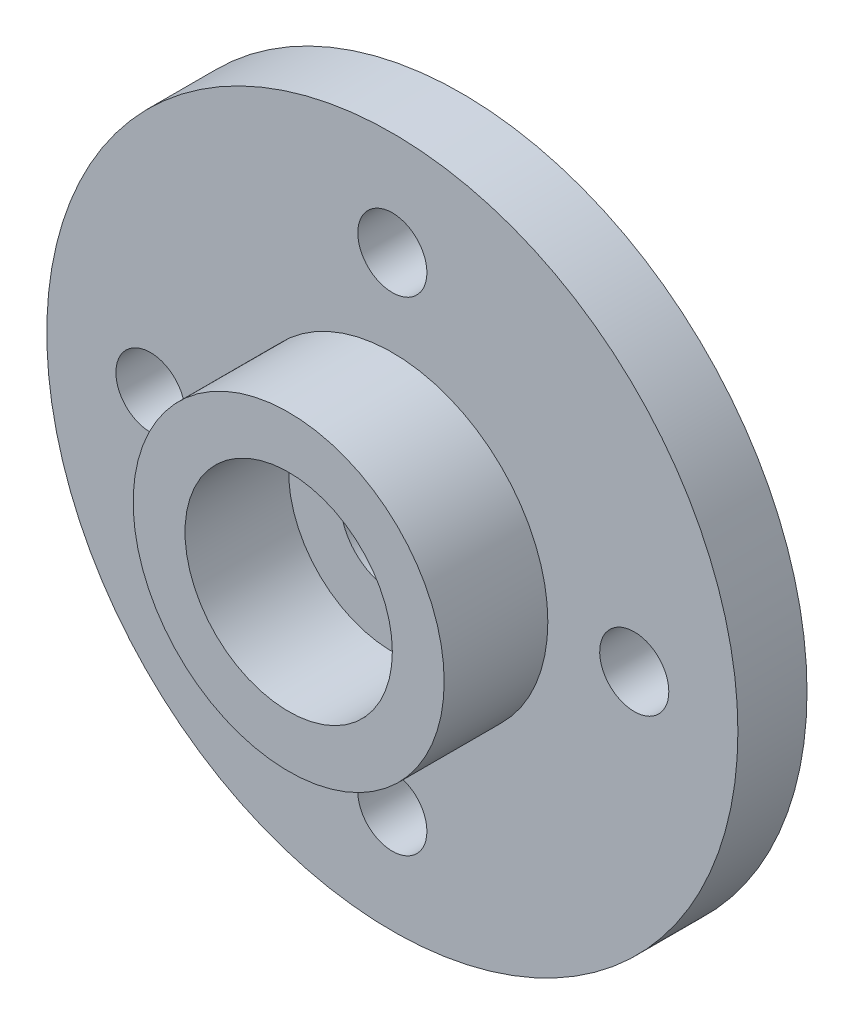
ISO-10303-21;
HEADER;
FILE_DESCRIPTION(('STEP AP214'),'2;1');
FILE_NAME('part.step','',(''),(''),'','','');
FILE_SCHEMA(('AUTOMOTIVE_DESIGN { 1 0 10303 214 1 1 1 1 }'));
ENDSEC;
DATA;
#1=APPLICATION_CONTEXT('core data for automotive mechanical design processes');
#2=APPLICATION_PROTOCOL_DEFINITION('international standard','automotive_design',2000,#1);
#3=PRODUCT_CONTEXT('',#1,'mechanical');
#4=PRODUCT('Part','Part','',(#3));
#5=PRODUCT_RELATED_PRODUCT_CATEGORY('part','',(#4));
#6=PRODUCT_DEFINITION_FORMATION('','',#4);
#7=PRODUCT_DEFINITION_CONTEXT('part definition',#1,'design');
#8=PRODUCT_DEFINITION('design','',#6,#7);
#9=PRODUCT_DEFINITION_SHAPE('','',#8);
#10=(LENGTH_UNIT() NAMED_UNIT(*) SI_UNIT(.MILLI.,.METRE.));
#11=(NAMED_UNIT(*) PLANE_ANGLE_UNIT() SI_UNIT($,.RADIAN.));
#12=(NAMED_UNIT(*) SI_UNIT($,.STERADIAN.) SOLID_ANGLE_UNIT());
#13=UNCERTAINTY_MEASURE_WITH_UNIT(LENGTH_MEASURE(1.E-05),#10,'distance_accuracy_value','');
#14=(GEOMETRIC_REPRESENTATION_CONTEXT(3) GLOBAL_UNCERTAINTY_ASSIGNED_CONTEXT((#13)) GLOBAL_UNIT_ASSIGNED_CONTEXT((#10,
#11,#12)) REPRESENTATION_CONTEXT('',''));
#15=CARTESIAN_POINT('',(0.,0.,0.));
#16=DIRECTION('',(0.,0.,1.));
#17=DIRECTION('',(1.,0.,0.));
#18=AXIS2_PLACEMENT_3D('',#15,#16,#17);
#19=CARTESIAN_POINT('',(0.,0.,2.));
#20=DIRECTION('',(0.,0.,1.));
#21=DIRECTION('',(1.,0.,0.));
#22=AXIS2_PLACEMENT_3D('',#19,#20,#21);
#23=PLANE('',#22);
#24=CARTESIAN_POINT('',(0.,0.,2.));
#25=DIRECTION('',(0.,0.,1.));
#26=DIRECTION('',(1.,0.,0.));
#27=AXIS2_PLACEMENT_3D('',#24,#25,#26);
#28=CIRCLE('',#27,1.5);
#29=CARTESIAN_POINT('',(1.5,0.,2.));
#30=VERTEX_POINT('',#29);
#31=EDGE_CURVE('E46',#30,#30,#28,.T.);
#32=ORIENTED_EDGE('',*,*,#31,.F.);
#33=EDGE_LOOP('',(#32));
#34=FACE_BOUND('',#33,.T.);
#35=CARTESIAN_POINT('',(0.,0.,2.));
#36=DIRECTION('',(0.,0.,1.));
#37=DIRECTION('',(1.,0.,0.));
#38=AXIS2_PLACEMENT_3D('',#35,#36,#37);
#39=CIRCLE('',#38,3.);
#40=CARTESIAN_POINT('',(3.,0.,2.));
#41=VERTEX_POINT('',#40);
#42=EDGE_CURVE('E10',#41,#41,#39,.F.);
#43=ORIENTED_EDGE('',*,*,#42,.F.);
#44=EDGE_LOOP('',(#43));
#45=FACE_BOUND('',#44,.T.);
#46=ADVANCED_FACE('F30',(#34,#45),#23,.T.);
#47=CARTESIAN_POINT('',(7.,0.,2.));
#48=DIRECTION('',(0.,0.,1.));
#49=DIRECTION('',(1.,0.,0.));
#50=AXIS2_PLACEMENT_3D('',#47,#48,#49);
#51=CIRCLE('',#50,1.);
#52=CARTESIAN_POINT('',(8.,0.,2.));
#53=VERTEX_POINT('',#52);
#54=EDGE_CURVE('E68',#53,#53,#51,.F.);
#55=ORIENTED_EDGE('',*,*,#54,.T.);
#56=EDGE_LOOP('',(#55));
#57=FACE_BOUND('',#56,.T.);
#58=CARTESIAN_POINT('',(0.,-7.,2.));
#59=DIRECTION('',(0.,0.,1.));
#60=DIRECTION('',(1.,0.,0.));
#61=AXIS2_PLACEMENT_3D('',#58,#59,#60);
#62=CIRCLE('',#61,1.);
#63=CARTESIAN_POINT('',(1.,-7.,2.));
#64=VERTEX_POINT('',#63);
#65=EDGE_CURVE('E76',#64,#64,#62,.F.);
#66=ORIENTED_EDGE('',*,*,#65,.T.);
#67=EDGE_LOOP('',(#66));
#68=FACE_BOUND('',#67,.T.);
#69=CARTESIAN_POINT('',(-7.,0.,2.));
#70=DIRECTION('',(0.,0.,1.));
#71=DIRECTION('',(1.,0.,0.));
#72=AXIS2_PLACEMENT_3D('',#69,#70,#71);
#73=CIRCLE('',#72,1.);
#74=CARTESIAN_POINT('',(-6.,0.,2.));
#75=VERTEX_POINT('',#74);
#76=EDGE_CURVE('E69',#75,#75,#73,.F.);
#77=ORIENTED_EDGE('',*,*,#76,.T.);
#78=EDGE_LOOP('',(#77));
#79=FACE_BOUND('',#78,.T.);
#80=CARTESIAN_POINT('',(0.,7.,2.));
#81=DIRECTION('',(0.,0.,1.));
#82=DIRECTION('',(1.,0.,0.));
#83=AXIS2_PLACEMENT_3D('',#80,#81,#82);
#84=CIRCLE('',#83,1.);
#85=CARTESIAN_POINT('',(1.,7.,2.));
#86=VERTEX_POINT('',#85);
#87=EDGE_CURVE('E62',#86,#86,#84,.F.);
#88=ORIENTED_EDGE('',*,*,#87,.T.);
#89=EDGE_LOOP('',(#88));
#90=FACE_BOUND('',#89,.T.);
#91=CARTESIAN_POINT('',(0.,0.,2.));
#92=DIRECTION('',(0.,0.,1.));
#93=DIRECTION('',(1.,0.,0.));
#94=AXIS2_PLACEMENT_3D('',#91,#92,#93);
#95=CIRCLE('',#94,4.5);
#96=CARTESIAN_POINT('',(4.5,0.,2.));
#97=VERTEX_POINT('',#96);
#98=EDGE_CURVE('E54',#97,#97,#95,.T.);
#99=ORIENTED_EDGE('',*,*,#98,.F.);
#100=EDGE_LOOP('',(#99));
#101=FACE_BOUND('',#100,.T.);
#102=CARTESIAN_POINT('',(0.,0.,2.));
#103=DIRECTION('',(0.,0.,1.));
#104=DIRECTION('',(1.,0.,0.));
#105=AXIS2_PLACEMENT_3D('',#102,#103,#104);
#106=CIRCLE('',#105,10.);
#107=CARTESIAN_POINT('',(10.,0.,2.));
#108=VERTEX_POINT('',#107);
#109=EDGE_CURVE('E37',#108,#108,#106,.T.);
#110=ORIENTED_EDGE('',*,*,#109,.T.);
#111=EDGE_LOOP('',(#110));
#112=FACE_BOUND('',#111,.T.);
#113=ADVANCED_FACE('F93',(#57,#68,#79,#90,#101,#112),#23,.T.);
#114=CARTESIAN_POINT('',(0.,0.,0.));
#115=DIRECTION('',(0.,0.,1.));
#116=DIRECTION('',(1.,0.,0.));
#117=AXIS2_PLACEMENT_3D('',#114,#115,#116);
#118=PLANE('',#117);
#119=CARTESIAN_POINT('',(7.,0.,0.));
#120=DIRECTION('',(0.,0.,-1.));
#121=DIRECTION('',(0.,1.,0.));
#122=AXIS2_PLACEMENT_3D('',#119,#120,#121);
#123=CIRCLE('',#122,1.);
#124=CARTESIAN_POINT('',(7.,0.999999999999975,0.));
#125=VERTEX_POINT('',#124);
#126=EDGE_CURVE('E79',#125,#125,#123,.T.);
#127=ORIENTED_EDGE('',*,*,#126,.F.);
#128=EDGE_LOOP('',(#127));
#129=FACE_BOUND('',#128,.T.);
#130=CARTESIAN_POINT('',(0.,-7.,0.));
#131=DIRECTION('',(0.,0.,-1.));
#132=DIRECTION('',(1.,0.,0.));
#133=AXIS2_PLACEMENT_3D('',#130,#131,#132);
#134=CIRCLE('',#133,1.);
#135=CARTESIAN_POINT('',(1.,-7.,0.));
#136=VERTEX_POINT('',#135);
#137=EDGE_CURVE('E72',#136,#136,#134,.T.);
#138=ORIENTED_EDGE('',*,*,#137,.F.);
#139=EDGE_LOOP('',(#138));
#140=FACE_BOUND('',#139,.T.);
#141=CARTESIAN_POINT('',(-7.,0.,0.));
#142=DIRECTION('',(0.,0.,-1.));
#143=DIRECTION('',(0.,-1.,0.));
#144=AXIS2_PLACEMENT_3D('',#141,#142,#143);
#145=CIRCLE('',#144,1.);
#146=CARTESIAN_POINT('',(-7.00000000000001,-0.999999999999927,0.));
#147=VERTEX_POINT('',#146);
#148=EDGE_CURVE('E73',#147,#147,#145,.T.);
#149=ORIENTED_EDGE('',*,*,#148,.F.);
#150=EDGE_LOOP('',(#149));
#151=FACE_BOUND('',#150,.T.);
#152=CARTESIAN_POINT('',(0.,7.,0.));
#153=DIRECTION('',(0.,0.,-1.));
#154=DIRECTION('',(-1.,0.,0.));
#155=AXIS2_PLACEMENT_3D('',#152,#153,#154);
#156=CIRCLE('',#155,1.);
#157=CARTESIAN_POINT('',(-1.,7.,0.));
#158=VERTEX_POINT('',#157);
#159=EDGE_CURVE('E65',#158,#158,#156,.T.);
#160=ORIENTED_EDGE('',*,*,#159,.F.);
#161=EDGE_LOOP('',(#160));
#162=FACE_BOUND('',#161,.T.);
#163=CARTESIAN_POINT('',(0.,0.,0.));
#164=DIRECTION('',(0.,0.,1.));
#165=DIRECTION('',(1.,0.,0.));
#166=AXIS2_PLACEMENT_3D('',#163,#164,#165);
#167=CIRCLE('',#166,10.);
#168=CARTESIAN_POINT('',(10.,0.,0.));
#169=VERTEX_POINT('',#168);
#170=EDGE_CURVE('E41',#169,#169,#167,.T.);
#171=ORIENTED_EDGE('',*,*,#170,.F.);
#172=EDGE_LOOP('',(#171));
#173=FACE_BOUND('',#172,.T.);
#174=CARTESIAN_POINT('',(0.,0.,0.));
#175=DIRECTION('',(0.,0.,1.));
#176=DIRECTION('',(1.,0.,0.));
#177=AXIS2_PLACEMENT_3D('',#174,#175,#176);
#178=CIRCLE('',#177,1.5);
#179=CARTESIAN_POINT('',(1.5,0.,0.));
#180=VERTEX_POINT('',#179);
#181=EDGE_CURVE('E48',#180,#180,#178,.T.);
#182=ORIENTED_EDGE('',*,*,#181,.T.);
#183=EDGE_LOOP('',(#182));
#184=FACE_BOUND('',#183,.T.);
#185=ADVANCED_FACE('F90',(#129,#140,#151,#162,#173,#184),#118,.F.);
#186=CARTESIAN_POINT('',(0.,0.,2.));
#187=DIRECTION('',(0.,0.,-1.));
#188=DIRECTION('',(-1.,0.,0.));
#189=AXIS2_PLACEMENT_3D('',#186,#187,#188);
#190=CYLINDRICAL_SURFACE('',#189,10.);
#191=ORIENTED_EDGE('',*,*,#109,.F.);
#192=EDGE_LOOP('',(#191));
#193=FACE_BOUND('',#192,.T.);
#194=ORIENTED_EDGE('',*,*,#170,.T.);
#195=EDGE_LOOP('',(#194));
#196=FACE_BOUND('',#195,.T.);
#197=ADVANCED_FACE('F32',(#193,#196),#190,.T.);
#198=CARTESIAN_POINT('',(0.,0.,2.));
#199=DIRECTION('',(0.,0.,-1.));
#200=DIRECTION('',(-1.,0.,0.));
#201=AXIS2_PLACEMENT_3D('',#198,#199,#200);
#202=CYLINDRICAL_SURFACE('',#201,1.5);
#203=ORIENTED_EDGE('',*,*,#31,.T.);
#204=EDGE_LOOP('',(#203));
#205=FACE_BOUND('',#204,.T.);
#206=ORIENTED_EDGE('',*,*,#181,.F.);
#207=EDGE_LOOP('',(#206));
#208=FACE_BOUND('',#207,.T.);
#209=ADVANCED_FACE('F104',(#205,#208),#202,.F.);
#210=CARTESIAN_POINT('',(0.,0.,5.));
#211=DIRECTION('',(0.,0.,1.));
#212=DIRECTION('',(1.,0.,0.));
#213=AXIS2_PLACEMENT_3D('',#210,#211,#212);
#214=PLANE('',#213);
#215=CARTESIAN_POINT('',(0.,0.,5.));
#216=DIRECTION('',(0.,0.,1.));
#217=DIRECTION('',(1.,0.,0.));
#218=AXIS2_PLACEMENT_3D('',#215,#216,#217);
#219=CIRCLE('',#218,4.5);
#220=CARTESIAN_POINT('',(4.5,0.,5.));
#221=VERTEX_POINT('',#220);
#222=EDGE_CURVE('E51',#221,#221,#219,.T.);
#223=ORIENTED_EDGE('',*,*,#222,.T.);
#224=EDGE_LOOP('',(#223));
#225=FACE_BOUND('',#224,.T.);
#226=CARTESIAN_POINT('',(0.,0.,5.));
#227=DIRECTION('',(0.,0.,1.));
#228=DIRECTION('',(1.,0.,0.));
#229=AXIS2_PLACEMENT_3D('',#226,#227,#228);
#230=CIRCLE('',#229,3.);
#231=CARTESIAN_POINT('',(3.,0.,5.));
#232=VERTEX_POINT('',#231);
#233=EDGE_CURVE('E57',#232,#232,#230,.T.);
#234=ORIENTED_EDGE('',*,*,#233,.F.);
#235=EDGE_LOOP('',(#234));
#236=FACE_BOUND('',#235,.T.);
#237=ADVANCED_FACE('F106',(#225,#236),#214,.T.);
#238=CARTESIAN_POINT('',(0.,0.,5.));
#239=DIRECTION('',(0.,0.,-1.));
#240=DIRECTION('',(-1.,0.,0.));
#241=AXIS2_PLACEMENT_3D('',#238,#239,#240);
#242=CYLINDRICAL_SURFACE('',#241,4.5);
#243=ORIENTED_EDGE('',*,*,#222,.F.);
#244=EDGE_LOOP('',(#243));
#245=FACE_BOUND('',#244,.T.);
#246=ORIENTED_EDGE('',*,*,#98,.T.);
#247=EDGE_LOOP('',(#246));
#248=FACE_BOUND('',#247,.T.);
#249=ADVANCED_FACE('F113',(#245,#248),#242,.T.);
#250=CARTESIAN_POINT('',(0.,0.,5.));
#251=DIRECTION('',(0.,0.,-1.));
#252=DIRECTION('',(-1.,0.,0.));
#253=AXIS2_PLACEMENT_3D('',#250,#251,#252);
#254=CYLINDRICAL_SURFACE('',#253,3.);
#255=ORIENTED_EDGE('',*,*,#233,.T.);
#256=EDGE_LOOP('',(#255));
#257=FACE_BOUND('',#256,.T.);
#258=ORIENTED_EDGE('',*,*,#42,.T.);
#259=EDGE_LOOP('',(#258));
#260=FACE_BOUND('',#259,.T.);
#261=ADVANCED_FACE('F140',(#257,#260),#254,.F.);
#262=CARTESIAN_POINT('',(0.,7.,4.82842712474619));
#263=DIRECTION('',(0.,0.,-1.));
#264=DIRECTION('',(-1.,0.,0.));
#265=AXIS2_PLACEMENT_3D('',#262,#263,#264);
#266=CYLINDRICAL_SURFACE('',#265,1.);
#267=ORIENTED_EDGE('',*,*,#159,.T.);
#268=EDGE_LOOP('',(#267));
#269=FACE_BOUND('',#268,.T.);
#270=ORIENTED_EDGE('',*,*,#87,.F.);
#271=EDGE_LOOP('',(#270));
#272=FACE_BOUND('',#271,.T.);
#273=ADVANCED_FACE('F145',(#269,#272),#266,.F.);
#274=CARTESIAN_POINT('',(-7.,0.,4.82842712474619));
#275=DIRECTION('',(0.,0.,-1.));
#276=DIRECTION('',(-1.,0.,0.));
#277=AXIS2_PLACEMENT_3D('',#274,#275,#276);
#278=CYLINDRICAL_SURFACE('',#277,1.);
#279=ORIENTED_EDGE('',*,*,#148,.T.);
#280=EDGE_LOOP('',(#279));
#281=FACE_BOUND('',#280,.T.);
#282=ORIENTED_EDGE('',*,*,#76,.F.);
#283=EDGE_LOOP('',(#282));
#284=FACE_BOUND('',#283,.T.);
#285=ADVANCED_FACE('F152',(#281,#284),#278,.F.);
#286=CARTESIAN_POINT('',(0.,-7.,4.82842712474619));
#287=DIRECTION('',(0.,0.,-1.));
#288=DIRECTION('',(-1.,0.,0.));
#289=AXIS2_PLACEMENT_3D('',#286,#287,#288);
#290=CYLINDRICAL_SURFACE('',#289,1.);
#291=ORIENTED_EDGE('',*,*,#137,.T.);
#292=EDGE_LOOP('',(#291));
#293=FACE_BOUND('',#292,.T.);
#294=ORIENTED_EDGE('',*,*,#65,.F.);
#295=EDGE_LOOP('',(#294));
#296=FACE_BOUND('',#295,.T.);
#297=ADVANCED_FACE('F156',(#293,#296),#290,.F.);
#298=CARTESIAN_POINT('',(7.,0.,4.82842712474619));
#299=DIRECTION('',(0.,0.,-1.));
#300=DIRECTION('',(-1.,0.,0.));
#301=AXIS2_PLACEMENT_3D('',#298,#299,#300);
#302=CYLINDRICAL_SURFACE('',#301,1.);
#303=ORIENTED_EDGE('',*,*,#126,.T.);
#304=EDGE_LOOP('',(#303));
#305=FACE_BOUND('',#304,.T.);
#306=ORIENTED_EDGE('',*,*,#54,.F.);
#307=EDGE_LOOP('',(#306));
#308=FACE_BOUND('',#307,.T.);
#309=ADVANCED_FACE('F87',(#305,#308),#302,.F.);
#310=CLOSED_SHELL('',(#46,#113,#185,#197,#209,#237,#249,#261,#273,#285,#297,#309));
#311=MANIFOLD_SOLID_BREP('B2',#310);
#312=ADVANCED_BREP_SHAPE_REPRESENTATION('',(#18,#311),#14);
#313=SHAPE_DEFINITION_REPRESENTATION(#9,#312);
ENDSEC;
END-ISO-10303-21;
